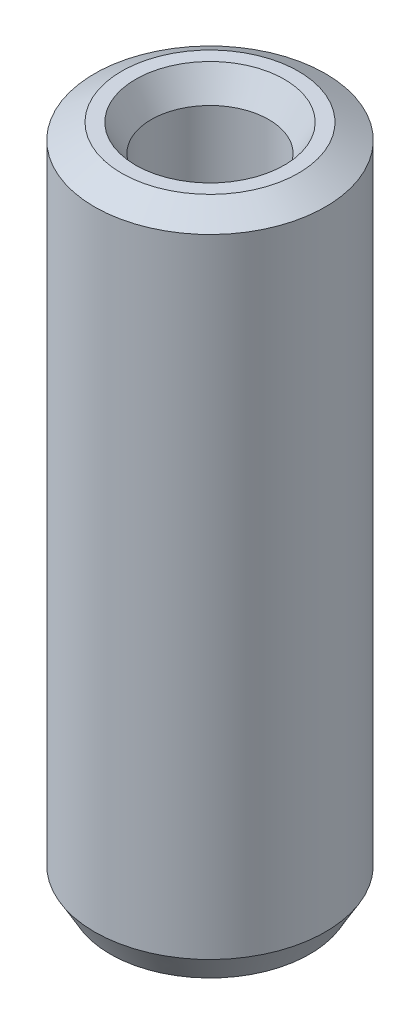
ISO-10303-21;
HEADER;
FILE_DESCRIPTION(('STEP AP214'),'2;1');
FILE_NAME('part.step','',(''),(''),'','','');
FILE_SCHEMA(('AUTOMOTIVE_DESIGN { 1 0 10303 214 1 1 1 1 }'));
ENDSEC;
DATA;
#1=APPLICATION_CONTEXT('core data for automotive mechanical design processes');
#2=APPLICATION_PROTOCOL_DEFINITION('international standard','automotive_design',2000,#1);
#3=PRODUCT_CONTEXT('',#1,'mechanical');
#4=PRODUCT('Part','Part','',(#3));
#5=PRODUCT_RELATED_PRODUCT_CATEGORY('part','',(#4));
#6=PRODUCT_DEFINITION_FORMATION('','',#4);
#7=PRODUCT_DEFINITION_CONTEXT('part definition',#1,'design');
#8=PRODUCT_DEFINITION('design','',#6,#7);
#9=PRODUCT_DEFINITION_SHAPE('','',#8);
#10=(LENGTH_UNIT() NAMED_UNIT(*) SI_UNIT(.MILLI.,.METRE.));
#11=(NAMED_UNIT(*) PLANE_ANGLE_UNIT() SI_UNIT($,.RADIAN.));
#12=(NAMED_UNIT(*) SI_UNIT($,.STERADIAN.) SOLID_ANGLE_UNIT());
#13=UNCERTAINTY_MEASURE_WITH_UNIT(LENGTH_MEASURE(1.E-05),#10,'distance_accuracy_value','');
#14=(GEOMETRIC_REPRESENTATION_CONTEXT(3) GLOBAL_UNCERTAINTY_ASSIGNED_CONTEXT((#13)) GLOBAL_UNIT_ASSIGNED_CONTEXT((#10,
#11,#12)) REPRESENTATION_CONTEXT('',''));
#15=CARTESIAN_POINT('',(0.,0.,0.));
#16=DIRECTION('',(0.,0.,1.));
#17=DIRECTION('',(1.,0.,0.));
#18=AXIS2_PLACEMENT_3D('',#15,#16,#17);
#19=CARTESIAN_POINT('',(0.,101.632506447697,0.));
#20=DIRECTION('',(0.,-1.,0.));
#21=DIRECTION('',(0.,0.,-1.));
#22=AXIS2_PLACEMENT_3D('',#19,#20,#21);
#23=CYLINDRICAL_SURFACE('',#22,17.5);
#24=CARTESIAN_POINT('',(0.,4.09966018784815,0.));
#25=DIRECTION('',(0.,1.,0.));
#26=DIRECTION('',(0.,0.,1.));
#27=AXIS2_PLACEMENT_3D('',#24,#25,#26);
#28=CIRCLE('',#27,17.5);
#29=CARTESIAN_POINT('',(0.,4.09966018784815,17.5));
#30=VERTEX_POINT('',#29);
#31=EDGE_CURVE('E10',#30,#30,#28,.T.);
#32=ORIENTED_EDGE('',*,*,#31,.T.);
#33=EDGE_LOOP('',(#32));
#34=FACE_BOUND('',#33,.T.);
#35=CARTESIAN_POINT('',(0.,99.2655665346571,0.));
#36=DIRECTION('',(0.,1.,0.));
#37=DIRECTION('',(0.,0.,1.));
#38=AXIS2_PLACEMENT_3D('',#35,#36,#37);
#39=CIRCLE('',#38,17.5);
#40=CARTESIAN_POINT('',(0.,99.2655665346571,17.5));
#41=VERTEX_POINT('',#40);
#42=EDGE_CURVE('E50',#41,#41,#39,.F.);
#43=ORIENTED_EDGE('',*,*,#42,.T.);
#44=EDGE_LOOP('',(#43));
#45=FACE_BOUND('',#44,.T.);
#46=ADVANCED_FACE('F39',(#34,#45),#23,.T.);
#47=CARTESIAN_POINT('',(0.,101.632506447697,0.));
#48=DIRECTION('',(0.,1.,0.));
#49=DIRECTION('',(0.,0.,1.));
#50=AXIS2_PLACEMENT_3D('',#47,#48,#49);
#51=PLANE('',#50);
#52=CARTESIAN_POINT('',(0.,101.632506447697,0.));
#53=DIRECTION('',(0.,1.,0.));
#54=DIRECTION('',(0.,0.,1.));
#55=AXIS2_PLACEMENT_3D('',#52,#53,#54);
#56=CIRCLE('',#55,11.277784776043);
#57=CARTESIAN_POINT('',(0.,101.632506447697,11.277784776043));
#58=VERTEX_POINT('',#57);
#59=EDGE_CURVE('E58',#58,#58,#56,.F.);
#60=ORIENTED_EDGE('',*,*,#59,.T.);
#61=EDGE_LOOP('',(#60));
#62=FACE_BOUND('',#61,.T.);
#63=CARTESIAN_POINT('',(0.,101.632506447697,0.));
#64=DIRECTION('',(0.,1.,0.));
#65=DIRECTION('',(0.,0.,1.));
#66=AXIS2_PLACEMENT_3D('',#63,#64,#65);
#67=CIRCLE('',#66,13.4003398121518);
#68=CARTESIAN_POINT('',(0.,101.632506447697,13.4003398121518));
#69=VERTEX_POINT('',#68);
#70=EDGE_CURVE('E61',#69,#69,#67,.T.);
#71=ORIENTED_EDGE('',*,*,#70,.T.);
#72=EDGE_LOOP('',(#71));
#73=FACE_BOUND('',#72,.T.);
#74=ADVANCED_FACE('F88',(#62,#73),#51,.T.);
#75=CARTESIAN_POINT('',(0.,0.,0.));
#76=DIRECTION('',(0.,1.,0.));
#77=DIRECTION('',(0.,0.,1.));
#78=AXIS2_PLACEMENT_3D('',#75,#76,#77);
#79=PLANE('',#78);
#80=CARTESIAN_POINT('',(0.,0.,0.));
#81=DIRECTION('',(0.,1.,0.));
#82=DIRECTION('',(0.,0.,1.));
#83=AXIS2_PLACEMENT_3D('',#80,#81,#82);
#84=CIRCLE('',#83,13.010505050851);
#85=CARTESIAN_POINT('',(0.,0.,13.010505050851));
#86=VERTEX_POINT('',#85);
#87=EDGE_CURVE('E51',#86,#86,#84,.T.);
#88=ORIENTED_EDGE('',*,*,#87,.T.);
#89=EDGE_LOOP('',(#88));
#90=FACE_BOUND('',#89,.T.);
#91=CARTESIAN_POINT('',(0.,0.,0.));
#92=DIRECTION('',(0.,1.,0.));
#93=DIRECTION('',(0.,0.,1.));
#94=AXIS2_PLACEMENT_3D('',#91,#92,#93);
#95=CIRCLE('',#94,15.1330600869599);
#96=CARTESIAN_POINT('',(0.,0.,15.1330600869599));
#97=VERTEX_POINT('',#96);
#98=EDGE_CURVE('E54',#97,#97,#95,.F.);
#99=ORIENTED_EDGE('',*,*,#98,.T.);
#100=EDGE_LOOP('',(#99));
#101=FACE_BOUND('',#100,.T.);
#102=ADVANCED_FACE('F83',(#90,#101),#79,.F.);
#103=CARTESIAN_POINT('',(0.,101.632506447697,0.));
#104=DIRECTION('',(0.,-1.,0.));
#105=DIRECTION('',(0.,0.,-1.));
#106=AXIS2_PLACEMENT_3D('',#103,#104,#105);
#107=CYLINDRICAL_SURFACE('',#106,8.91084486300285);
#108=CARTESIAN_POINT('',(0.,97.5328462598491,0.));
#109=DIRECTION('',(0.,1.,0.));
#110=DIRECTION('',(0.,0.,1.));
#111=AXIS2_PLACEMENT_3D('',#108,#109,#110);
#112=CIRCLE('',#111,8.91084486300285);
#113=CARTESIAN_POINT('',(0.,97.5328462598491,8.91084486300285));
#114=VERTEX_POINT('',#113);
#115=EDGE_CURVE('E67',#114,#114,#112,.T.);
#116=ORIENTED_EDGE('',*,*,#115,.T.);
#117=EDGE_LOOP('',(#116));
#118=FACE_BOUND('',#117,.T.);
#119=CARTESIAN_POINT('',(0.,2.36693991304014,0.));
#120=DIRECTION('',(0.,1.,0.));
#121=DIRECTION('',(0.,0.,1.));
#122=AXIS2_PLACEMENT_3D('',#119,#120,#121);
#123=CIRCLE('',#122,8.91084486300285);
#124=CARTESIAN_POINT('',(0.,2.36693991304014,8.91084486300285));
#125=VERTEX_POINT('',#124);
#126=EDGE_CURVE('E69',#125,#125,#123,.F.);
#127=ORIENTED_EDGE('',*,*,#126,.T.);
#128=EDGE_LOOP('',(#127));
#129=FACE_BOUND('',#128,.T.);
#130=ADVANCED_FACE('F71',(#118,#129),#107,.F.);
#131=CARTESIAN_POINT('',(0.,97.5328462598491,0.));
#132=DIRECTION('',(0.,1.,0.));
#133=DIRECTION('',(0.,0.,1.));
#134=AXIS2_PLACEMENT_3D('',#131,#132,#133);
#135=CONICAL_SURFACE('',#134,8.91084486300285,0.523598775598304);
#136=ORIENTED_EDGE('',*,*,#59,.F.);
#137=EDGE_LOOP('',(#136));
#138=FACE_BOUND('',#137,.T.);
#139=ORIENTED_EDGE('',*,*,#115,.F.);
#140=EDGE_LOOP('',(#139));
#141=FACE_BOUND('',#140,.T.);
#142=ADVANCED_FACE('F77',(#138,#141),#135,.F.);
#143=CARTESIAN_POINT('',(0.,0.,0.));
#144=DIRECTION('',(0.,-1.,0.));
#145=DIRECTION('',(0.,0.,-1.));
#146=AXIS2_PLACEMENT_3D('',#143,#144,#145);
#147=CONICAL_SURFACE('',#146,13.010505050851,1.04719755119659);
#148=ORIENTED_EDGE('',*,*,#126,.F.);
#149=EDGE_LOOP('',(#148));
#150=FACE_BOUND('',#149,.T.);
#151=ORIENTED_EDGE('',*,*,#87,.F.);
#152=EDGE_LOOP('',(#151));
#153=FACE_BOUND('',#152,.T.);
#154=ADVANCED_FACE('F73',(#150,#153),#147,.F.);
#155=CARTESIAN_POINT('',(0.,4.09966018784815,0.));
#156=DIRECTION('',(0.,1.,0.));
#157=DIRECTION('',(0.,0.,1.));
#158=AXIS2_PLACEMENT_3D('',#155,#156,#157);
#159=CONICAL_SURFACE('',#158,17.5,0.523598775598301);
#160=ORIENTED_EDGE('',*,*,#98,.F.);
#161=EDGE_LOOP('',(#160));
#162=FACE_BOUND('',#161,.T.);
#163=ORIENTED_EDGE('',*,*,#31,.F.);
#164=EDGE_LOOP('',(#163));
#165=FACE_BOUND('',#164,.T.);
#166=ADVANCED_FACE('F76',(#162,#165),#159,.T.);
#167=CARTESIAN_POINT('',(0.,101.632506447697,0.));
#168=DIRECTION('',(0.,-1.,0.));
#169=DIRECTION('',(0.,0.,-1.));
#170=AXIS2_PLACEMENT_3D('',#167,#168,#169);
#171=CONICAL_SURFACE('',#170,13.4003398121518,1.0471975511966);
#172=ORIENTED_EDGE('',*,*,#42,.F.);
#173=EDGE_LOOP('',(#172));
#174=FACE_BOUND('',#173,.T.);
#175=ORIENTED_EDGE('',*,*,#70,.F.);
#176=EDGE_LOOP('',(#175));
#177=FACE_BOUND('',#176,.T.);
#178=ADVANCED_FACE('F45',(#174,#177),#171,.T.);
#179=CLOSED_SHELL('',(#46,#74,#102,#130,#142,#154,#166,#178));
#180=MANIFOLD_SOLID_BREP('B2',#179);
#181=ADVANCED_BREP_SHAPE_REPRESENTATION('',(#18,#180),#14);
#182=SHAPE_DEFINITION_REPRESENTATION(#9,#181);
ENDSEC;
END-ISO-10303-21;
